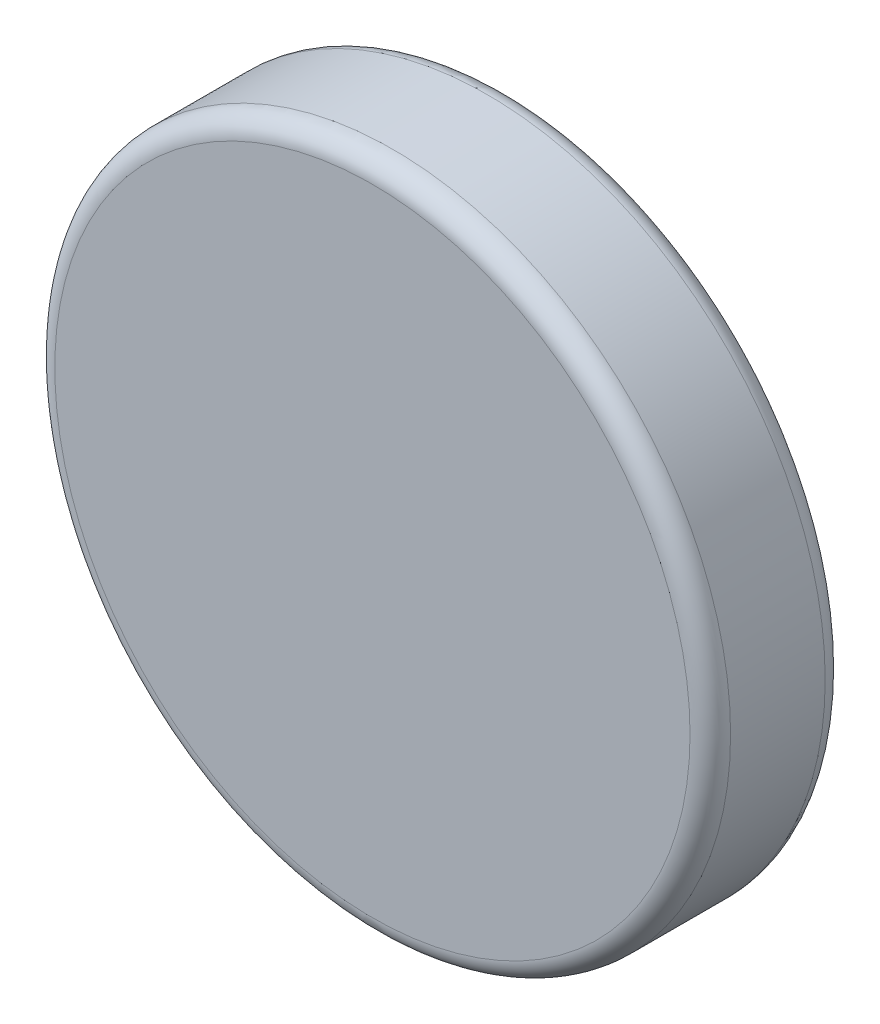
ISO-10303-21;
HEADER;
FILE_DESCRIPTION(('STEP AP214'),'2;1');
FILE_NAME('part.step','',(''),(''),'','','');
FILE_SCHEMA(('AUTOMOTIVE_DESIGN { 1 0 10303 214 1 1 1 1 }'));
ENDSEC;
DATA;
#1=APPLICATION_CONTEXT('core data for automotive mechanical design processes');
#2=APPLICATION_PROTOCOL_DEFINITION('international standard','automotive_design',2000,#1);
#3=PRODUCT_CONTEXT('',#1,'mechanical');
#4=PRODUCT('Part','Part','',(#3));
#5=PRODUCT_RELATED_PRODUCT_CATEGORY('part','',(#4));
#6=PRODUCT_DEFINITION_FORMATION('','',#4);
#7=PRODUCT_DEFINITION_CONTEXT('part definition',#1,'design');
#8=PRODUCT_DEFINITION('design','',#6,#7);
#9=PRODUCT_DEFINITION_SHAPE('','',#8);
#10=(LENGTH_UNIT() NAMED_UNIT(*) SI_UNIT(.MILLI.,.METRE.));
#11=(NAMED_UNIT(*) PLANE_ANGLE_UNIT() SI_UNIT($,.RADIAN.));
#12=(NAMED_UNIT(*) SI_UNIT($,.STERADIAN.) SOLID_ANGLE_UNIT());
#13=UNCERTAINTY_MEASURE_WITH_UNIT(LENGTH_MEASURE(1.E-05),#10,'distance_accuracy_value','');
#14=(GEOMETRIC_REPRESENTATION_CONTEXT(3) GLOBAL_UNCERTAINTY_ASSIGNED_CONTEXT((#13)) GLOBAL_UNIT_ASSIGNED_CONTEXT((#10,
#11,#12)) REPRESENTATION_CONTEXT('',''));
#15=CARTESIAN_POINT('',(0.,0.,0.));
#16=DIRECTION('',(0.,0.,1.));
#17=DIRECTION('',(1.,0.,0.));
#18=AXIS2_PLACEMENT_3D('',#15,#16,#17);
#19=CARTESIAN_POINT('',(0.,0.,2.));
#20=DIRECTION('',(0.,0.,-1.));
#21=DIRECTION('',(-1.,0.,0.));
#22=AXIS2_PLACEMENT_3D('',#19,#20,#21);
#23=CYLINDRICAL_SURFACE('',#22,5.);
#24=CARTESIAN_POINT('',(0.,0.,0.3));
#25=DIRECTION('',(0.,0.,1.));
#26=DIRECTION('',(1.,0.,0.));
#27=AXIS2_PLACEMENT_3D('',#24,#25,#26);
#28=CIRCLE('',#27,5.);
#29=CARTESIAN_POINT('',(5.,0.,0.3));
#30=VERTEX_POINT('',#29);
#31=EDGE_CURVE('E41',#30,#30,#28,.T.);
#32=ORIENTED_EDGE('',*,*,#31,.T.);
#33=EDGE_LOOP('',(#32));
#34=FACE_BOUND('',#33,.T.);
#35=CARTESIAN_POINT('',(0.,0.,1.7));
#36=DIRECTION('',(0.,0.,1.));
#37=DIRECTION('',(1.,0.,0.));
#38=AXIS2_PLACEMENT_3D('',#35,#36,#37);
#39=CIRCLE('',#38,5.);
#40=CARTESIAN_POINT('',(5.,0.,1.7));
#41=VERTEX_POINT('',#40);
#42=EDGE_CURVE('E45',#41,#41,#39,.F.);
#43=ORIENTED_EDGE('',*,*,#42,.T.);
#44=EDGE_LOOP('',(#43));
#45=FACE_BOUND('',#44,.T.);
#46=ADVANCED_FACE('F30',(#34,#45),#23,.T.);
#47=CARTESIAN_POINT('',(0.,0.,2.));
#48=DIRECTION('',(0.,0.,1.));
#49=DIRECTION('',(1.,0.,0.));
#50=AXIS2_PLACEMENT_3D('',#47,#48,#49);
#51=PLANE('',#50);
#52=CARTESIAN_POINT('',(0.,0.,2.));
#53=DIRECTION('',(0.,0.,1.));
#54=DIRECTION('',(1.,0.,0.));
#55=AXIS2_PLACEMENT_3D('',#52,#53,#54);
#56=CIRCLE('',#55,4.7);
#57=CARTESIAN_POINT('',(4.7,0.,2.));
#58=VERTEX_POINT('',#57);
#59=EDGE_CURVE('E10',#58,#58,#56,.T.);
#60=ORIENTED_EDGE('',*,*,#59,.T.);
#61=EDGE_LOOP('',(#60));
#62=FACE_BOUND('',#61,.T.);
#63=ADVANCED_FACE('F61',(#62),#51,.T.);
#64=CARTESIAN_POINT('',(0.,0.,0.));
#65=DIRECTION('',(0.,0.,1.));
#66=DIRECTION('',(1.,0.,0.));
#67=AXIS2_PLACEMENT_3D('',#64,#65,#66);
#68=PLANE('',#67);
#69=CARTESIAN_POINT('',(0.,0.,0.));
#70=DIRECTION('',(0.,0.,1.));
#71=DIRECTION('',(1.,0.,0.));
#72=AXIS2_PLACEMENT_3D('',#69,#70,#71);
#73=CIRCLE('',#72,4.7);
#74=CARTESIAN_POINT('',(4.7,0.,0.));
#75=VERTEX_POINT('',#74);
#76=EDGE_CURVE('E37',#75,#75,#73,.F.);
#77=ORIENTED_EDGE('',*,*,#76,.T.);
#78=EDGE_LOOP('',(#77));
#79=FACE_BOUND('',#78,.T.);
#80=ADVANCED_FACE('F58',(#79),#68,.F.);
#81=CARTESIAN_POINT('',(0.,0.,0.3));
#82=DIRECTION('',(0.,0.,1.));
#83=DIRECTION('',(1.,0.,0.));
#84=AXIS2_PLACEMENT_3D('',#81,#82,#83);
#85=TOROIDAL_SURFACE('',#84,4.7,0.3);
#86=ORIENTED_EDGE('',*,*,#76,.F.);
#87=EDGE_LOOP('',(#86));
#88=FACE_BOUND('',#87,.T.);
#89=ORIENTED_EDGE('',*,*,#31,.F.);
#90=EDGE_LOOP('',(#89));
#91=FACE_BOUND('',#90,.T.);
#92=ADVANCED_FACE('F54',(#88,#91),#85,.T.);
#93=CARTESIAN_POINT('',(0.,0.,1.7));
#94=DIRECTION('',(0.,0.,1.));
#95=DIRECTION('',(1.,0.,0.));
#96=AXIS2_PLACEMENT_3D('',#93,#94,#95);
#97=TOROIDAL_SURFACE('',#96,4.7,0.3);
#98=ORIENTED_EDGE('',*,*,#42,.F.);
#99=EDGE_LOOP('',(#98));
#100=FACE_BOUND('',#99,.T.);
#101=ORIENTED_EDGE('',*,*,#59,.F.);
#102=EDGE_LOOP('',(#101));
#103=FACE_BOUND('',#102,.T.);
#104=ADVANCED_FACE('F32',(#100,#103),#97,.T.);
#105=CLOSED_SHELL('',(#46,#63,#80,#92,#104));
#106=MANIFOLD_SOLID_BREP('B2',#105);
#107=ADVANCED_BREP_SHAPE_REPRESENTATION('',(#18,#106),#14);
#108=SHAPE_DEFINITION_REPRESENTATION(#9,#107);
ENDSEC;
END-ISO-10303-21;
